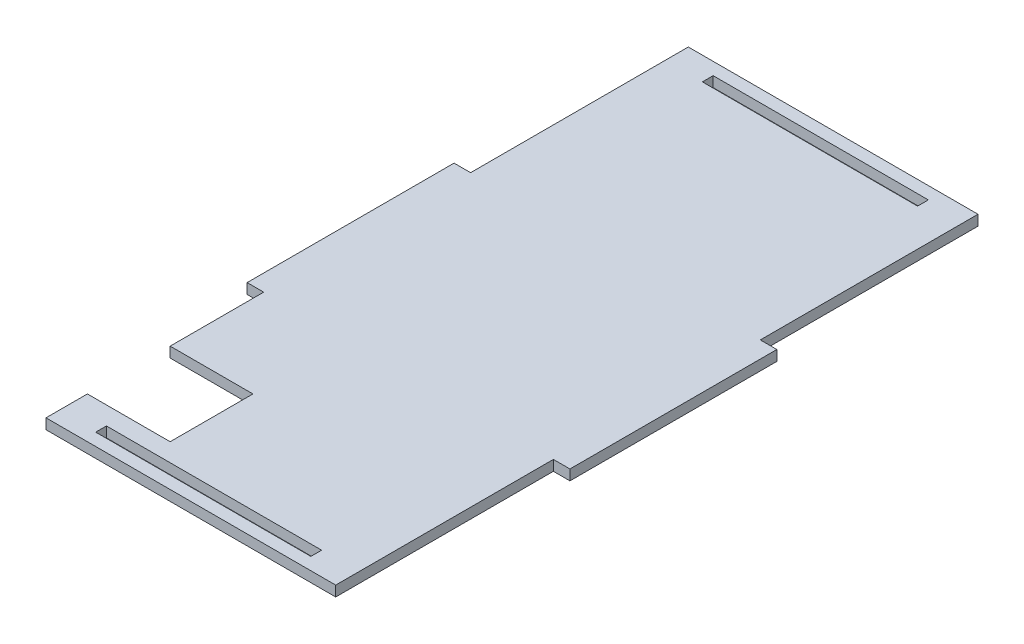
ISO-10303-21;
HEADER;
FILE_DESCRIPTION(('STEP AP214'),'2;1');
FILE_NAME('part.step','',(''),(''),'','','');
FILE_SCHEMA(('AUTOMOTIVE_DESIGN { 1 0 10303 214 1 1 1 1 }'));
ENDSEC;
DATA;
#1=APPLICATION_CONTEXT('core data for automotive mechanical design processes');
#2=APPLICATION_PROTOCOL_DEFINITION('international standard','automotive_design',2000,#1);
#3=PRODUCT_CONTEXT('',#1,'mechanical');
#4=PRODUCT('Part','Part','',(#3));
#5=PRODUCT_RELATED_PRODUCT_CATEGORY('part','',(#4));
#6=PRODUCT_DEFINITION_FORMATION('','',#4);
#7=PRODUCT_DEFINITION_CONTEXT('part definition',#1,'design');
#8=PRODUCT_DEFINITION('design','',#6,#7);
#9=PRODUCT_DEFINITION_SHAPE('','',#8);
#10=(LENGTH_UNIT() NAMED_UNIT(*) SI_UNIT(.MILLI.,.METRE.));
#11=(NAMED_UNIT(*) PLANE_ANGLE_UNIT() SI_UNIT($,.RADIAN.));
#12=(NAMED_UNIT(*) SI_UNIT($,.STERADIAN.) SOLID_ANGLE_UNIT());
#13=UNCERTAINTY_MEASURE_WITH_UNIT(LENGTH_MEASURE(1.E-05),#10,'distance_accuracy_value','');
#14=(GEOMETRIC_REPRESENTATION_CONTEXT(3) GLOBAL_UNCERTAINTY_ASSIGNED_CONTEXT((#13)) GLOBAL_UNIT_ASSIGNED_CONTEXT((#10,
#11,#12)) REPRESENTATION_CONTEXT('',''));
#15=CARTESIAN_POINT('',(0.,0.,0.));
#16=DIRECTION('',(0.,0.,1.));
#17=DIRECTION('',(1.,0.,0.));
#18=AXIS2_PLACEMENT_3D('',#15,#16,#17);
#19=CARTESIAN_POINT('',(0.,2.5,0.));
#20=DIRECTION('',(0.,1.,0.));
#21=DIRECTION('',(0.,0.,1.));
#22=AXIS2_PLACEMENT_3D('',#19,#20,#21);
#23=PLANE('',#22);
#24=DIRECTION('',(0.,0.,1.));
#25=VECTOR('',#24,1.);
#26=CARTESIAN_POINT('',(-35.0000000000006,2.5,47.6));
#27=LINE('',#26,#25);
#28=CARTESIAN_POINT('',(-35.,2.5,25.));
#29=VERTEX_POINT('',#28);
#30=CARTESIAN_POINT('',(-35.0000000000006,2.5,47.6));
#31=VERTEX_POINT('',#30);
#32=EDGE_CURVE('E292',#29,#31,#27,.T.);
#33=ORIENTED_EDGE('',*,*,#32,.T.);
#34=DIRECTION('',(1.,0.,0.));
#35=VECTOR('',#34,1.);
#36=CARTESIAN_POINT('',(-35.0000000000006,2.5,47.6));
#37=LINE('',#36,#35);
#38=CARTESIAN_POINT('',(-15.0000000000006,2.5,47.6));
#39=VERTEX_POINT('',#38);
#40=EDGE_CURVE('E296',#31,#39,#37,.T.);
#41=ORIENTED_EDGE('',*,*,#40,.T.);
#42=DIRECTION('',(0.,0.,1.));
#43=VECTOR('',#42,1.);
#44=CARTESIAN_POINT('',(-15.0000000000006,2.5,47.6));
#45=LINE('',#44,#43);
#46=CARTESIAN_POINT('',(-15.0000000000006,2.5,67.6));
#47=VERTEX_POINT('',#46);
#48=EDGE_CURVE('E300',#39,#47,#45,.T.);
#49=ORIENTED_EDGE('',*,*,#48,.T.);
#50=DIRECTION('',(-1.,0.,0.));
#51=VECTOR('',#50,1.);
#52=CARTESIAN_POINT('',(-15.0000000000006,2.5,67.6));
#53=LINE('',#52,#51);
#54=CARTESIAN_POINT('',(-35.0000000000006,2.5,67.6));
#55=VERTEX_POINT('',#54);
#56=EDGE_CURVE('E303',#47,#55,#53,.T.);
#57=ORIENTED_EDGE('',*,*,#56,.T.);
#58=DIRECTION('',(0.,0.,1.));
#59=VECTOR('',#58,1.);
#60=CARTESIAN_POINT('',(-35.,2.5,77.6));
#61=LINE('',#60,#59);
#62=CARTESIAN_POINT('',(-35.,2.5,77.6));
#63=VERTEX_POINT('',#62);
#64=EDGE_CURVE('E306',#55,#63,#61,.T.);
#65=ORIENTED_EDGE('',*,*,#64,.T.);
#66=DIRECTION('',(1.,0.,0.));
#67=VECTOR('',#66,1.);
#68=CARTESIAN_POINT('',(35.,2.5,77.6));
#69=LINE('',#68,#67);
#70=CARTESIAN_POINT('',(35.,2.5,77.6));
#71=VERTEX_POINT('',#70);
#72=EDGE_CURVE('E309',#63,#71,#69,.T.);
#73=ORIENTED_EDGE('',*,*,#72,.T.);
#74=DIRECTION('',(0.,0.,-1.));
#75=VECTOR('',#74,1.);
#76=CARTESIAN_POINT('',(34.9999999999998,2.5,25.0000000000003));
#77=LINE('',#76,#75);
#78=CARTESIAN_POINT('',(34.9999999999998,2.5,25.0000000000003));
#79=VERTEX_POINT('',#78);
#80=EDGE_CURVE('E312',#71,#79,#77,.T.);
#81=ORIENTED_EDGE('',*,*,#80,.T.);
#82=DIRECTION('',(1.,0.,-1.41379963292089E-13));
#83=VECTOR('',#82,1.);
#84=CARTESIAN_POINT('',(34.9999999999998,2.5,25.0000000000003));
#85=LINE('',#84,#83);
#86=CARTESIAN_POINT('',(39.0000000000004,2.5,24.9999999999997));
#87=VERTEX_POINT('',#86);
#88=EDGE_CURVE('E315',#79,#87,#85,.T.);
#89=ORIENTED_EDGE('',*,*,#88,.T.);
#90=DIRECTION('',(0.,0.,-1.));
#91=VECTOR('',#90,1.);
#92=CARTESIAN_POINT('',(39.,2.5,-25.0000000000003));
#93=LINE('',#92,#91);
#94=CARTESIAN_POINT('',(39.,2.5,-25.0000000000003));
#95=VERTEX_POINT('',#94);
#96=EDGE_CURVE('E318',#87,#95,#93,.T.);
#97=ORIENTED_EDGE('',*,*,#96,.T.);
#98=DIRECTION('',(-1.,0.,0.));
#99=VECTOR('',#98,1.);
#100=CARTESIAN_POINT('',(34.9999999999998,2.5,-25.0000000000003));
#101=LINE('',#100,#99);
#102=CARTESIAN_POINT('',(34.9999999999998,2.5,-25.0000000000003));
#103=VERTEX_POINT('',#102);
#104=EDGE_CURVE('E321',#95,#103,#101,.T.);
#105=ORIENTED_EDGE('',*,*,#104,.T.);
#106=DIRECTION('',(0.,0.,-1.));
#107=VECTOR('',#106,1.);
#108=CARTESIAN_POINT('',(34.9999999999998,2.5,-25.0000000000003));
#109=LINE('',#108,#107);
#110=CARTESIAN_POINT('',(35.,2.5,-77.6));
#111=VERTEX_POINT('',#110);
#112=EDGE_CURVE('E324',#103,#111,#109,.T.);
#113=ORIENTED_EDGE('',*,*,#112,.T.);
#114=DIRECTION('',(-1.,0.,0.));
#115=VECTOR('',#114,1.);
#116=CARTESIAN_POINT('',(35.,2.5,-77.6));
#117=LINE('',#116,#115);
#118=CARTESIAN_POINT('',(-35.,2.5,-77.6));
#119=VERTEX_POINT('',#118);
#120=EDGE_CURVE('E327',#111,#119,#117,.T.);
#121=ORIENTED_EDGE('',*,*,#120,.T.);
#122=DIRECTION('',(0.,0.,1.));
#123=VECTOR('',#122,1.);
#124=CARTESIAN_POINT('',(-35.,2.5,-77.6));
#125=LINE('',#124,#123);
#126=CARTESIAN_POINT('',(-35.,2.5,-25.));
#127=VERTEX_POINT('',#126);
#128=EDGE_CURVE('E330',#119,#127,#125,.T.);
#129=ORIENTED_EDGE('',*,*,#128,.T.);
#130=DIRECTION('',(-1.,0.,0.));
#131=VECTOR('',#130,1.);
#132=CARTESIAN_POINT('',(-35.,2.5,-25.));
#133=LINE('',#132,#131);
#134=CARTESIAN_POINT('',(-39.0000000000002,2.5,-25.));
#135=VERTEX_POINT('',#134);
#136=EDGE_CURVE('E333',#127,#135,#133,.T.);
#137=ORIENTED_EDGE('',*,*,#136,.T.);
#138=DIRECTION('',(0.,0.,1.));
#139=VECTOR('',#138,1.);
#140=CARTESIAN_POINT('',(-39.0000000000002,2.5,-25.));
#141=LINE('',#140,#139);
#142=CARTESIAN_POINT('',(-39.0000000000002,2.5,25.));
#143=VERTEX_POINT('',#142);
#144=EDGE_CURVE('E336',#135,#143,#141,.T.);
#145=ORIENTED_EDGE('',*,*,#144,.T.);
#146=DIRECTION('',(1.,0.,0.));
#147=VECTOR('',#146,1.);
#148=CARTESIAN_POINT('',(-35.,2.5,25.));
#149=LINE('',#148,#147);
#150=EDGE_CURVE('E339',#143,#29,#149,.T.);
#151=ORIENTED_EDGE('',*,*,#150,.T.);
#152=EDGE_LOOP('',(#33,#41,#49,#57,#65,#73,#81,#89,#97,#105,#113,#121,#129,#137,#145,#151));
#153=FACE_BOUND('',#152,.T.);
#154=DIRECTION('',(1.,0.,0.));
#155=VECTOR('',#154,1.);
#156=CARTESIAN_POINT('',(-26.,2.5,74.6));
#157=LINE('',#156,#155);
#158=CARTESIAN_POINT('',(-26.,2.5,74.6));
#159=VERTEX_POINT('',#158);
#160=CARTESIAN_POINT('',(26.,2.5,74.6));
#161=VERTEX_POINT('',#160);
#162=EDGE_CURVE('E252',#159,#161,#157,.T.);
#163=ORIENTED_EDGE('',*,*,#162,.F.);
#164=DIRECTION('',(0.,0.,1.));
#165=VECTOR('',#164,1.);
#166=CARTESIAN_POINT('',(-26.,2.5,74.6));
#167=LINE('',#166,#165);
#168=CARTESIAN_POINT('',(-26.,2.5,72.));
#169=VERTEX_POINT('',#168);
#170=EDGE_CURVE('E249',#169,#159,#167,.T.);
#171=ORIENTED_EDGE('',*,*,#170,.F.);
#172=DIRECTION('',(-1.,0.,0.));
#173=VECTOR('',#172,1.);
#174=CARTESIAN_POINT('',(-26.,2.5,72.));
#175=LINE('',#174,#173);
#176=CARTESIAN_POINT('',(26.,2.5,72.));
#177=VERTEX_POINT('',#176);
#178=EDGE_CURVE('E260',#177,#169,#175,.T.);
#179=ORIENTED_EDGE('',*,*,#178,.F.);
#180=DIRECTION('',(0.,0.,-1.));
#181=VECTOR('',#180,1.);
#182=CARTESIAN_POINT('',(26.,2.5,74.6));
#183=LINE('',#182,#181);
#184=EDGE_CURVE('E256',#161,#177,#183,.T.);
#185=ORIENTED_EDGE('',*,*,#184,.F.);
#186=EDGE_LOOP('',(#163,#171,#179,#185));
#187=FACE_BOUND('',#186,.T.);
#188=DIRECTION('',(0.,0.,1.));
#189=VECTOR('',#188,1.);
#190=CARTESIAN_POINT('',(-26.,2.5,-74.6));
#191=LINE('',#190,#189);
#192=CARTESIAN_POINT('',(-26.,2.5,-74.6));
#193=VERTEX_POINT('',#192);
#194=CARTESIAN_POINT('',(-26.,2.5,-72.));
#195=VERTEX_POINT('',#194);
#196=EDGE_CURVE('E210',#193,#195,#191,.T.);
#197=ORIENTED_EDGE('',*,*,#196,.F.);
#198=DIRECTION('',(-1.,0.,0.));
#199=VECTOR('',#198,1.);
#200=CARTESIAN_POINT('',(-26.,2.5,-74.6));
#201=LINE('',#200,#199);
#202=CARTESIAN_POINT('',(26.,2.5,-74.6));
#203=VERTEX_POINT('',#202);
#204=EDGE_CURVE('E201',#203,#193,#201,.T.);
#205=ORIENTED_EDGE('',*,*,#204,.F.);
#206=DIRECTION('',(0.,0.,-1.));
#207=VECTOR('',#206,1.);
#208=CARTESIAN_POINT('',(26.,2.5,-74.6));
#209=LINE('',#208,#207);
#210=CARTESIAN_POINT('',(26.,2.5,-72.));
#211=VERTEX_POINT('',#210);
#212=EDGE_CURVE('E227',#211,#203,#209,.T.);
#213=ORIENTED_EDGE('',*,*,#212,.F.);
#214=DIRECTION('',(1.,0.,0.));
#215=VECTOR('',#214,1.);
#216=CARTESIAN_POINT('',(-26.,2.5,-72.));
#217=LINE('',#216,#215);
#218=EDGE_CURVE('E223',#195,#211,#217,.T.);
#219=ORIENTED_EDGE('',*,*,#218,.F.);
#220=EDGE_LOOP('',(#197,#205,#213,#219));
#221=FACE_BOUND('',#220,.T.);
#222=ADVANCED_FACE('F39',(#153,#187,#221),#23,.T.);
#223=CARTESIAN_POINT('',(0.,0.,0.));
#224=DIRECTION('',(0.,1.,0.));
#225=DIRECTION('',(0.,0.,1.));
#226=AXIS2_PLACEMENT_3D('',#223,#224,#225);
#227=PLANE('',#226);
#228=DIRECTION('',(0.,0.,1.));
#229=VECTOR('',#228,1.);
#230=CARTESIAN_POINT('',(-26.,0.,74.6));
#231=LINE('',#230,#229);
#232=CARTESIAN_POINT('',(-26.,0.,72.));
#233=VERTEX_POINT('',#232);
#234=CARTESIAN_POINT('',(-26.,0.,74.6));
#235=VERTEX_POINT('',#234);
#236=EDGE_CURVE('E219',#233,#235,#231,.T.);
#237=ORIENTED_EDGE('',*,*,#236,.T.);
#238=DIRECTION('',(1.,0.,0.));
#239=VECTOR('',#238,1.);
#240=CARTESIAN_POINT('',(-26.,0.,74.6));
#241=LINE('',#240,#239);
#242=CARTESIAN_POINT('',(26.,0.,74.6));
#243=VERTEX_POINT('',#242);
#244=EDGE_CURVE('E267',#235,#243,#241,.T.);
#245=ORIENTED_EDGE('',*,*,#244,.T.);
#246=DIRECTION('',(0.,0.,-1.));
#247=VECTOR('',#246,1.);
#248=CARTESIAN_POINT('',(26.,0.,74.6));
#249=LINE('',#248,#247);
#250=CARTESIAN_POINT('',(26.,0.,72.));
#251=VERTEX_POINT('',#250);
#252=EDGE_CURVE('E271',#243,#251,#249,.T.);
#253=ORIENTED_EDGE('',*,*,#252,.T.);
#254=DIRECTION('',(-1.,0.,0.));
#255=VECTOR('',#254,1.);
#256=CARTESIAN_POINT('',(-26.,0.,72.));
#257=LINE('',#256,#255);
#258=EDGE_CURVE('E253',#251,#233,#257,.T.);
#259=ORIENTED_EDGE('',*,*,#258,.T.);
#260=EDGE_LOOP('',(#237,#245,#253,#259));
#261=FACE_BOUND('',#260,.T.);
#262=DIRECTION('',(0.,0.,1.));
#263=VECTOR('',#262,1.);
#264=CARTESIAN_POINT('',(-35.0000000000006,0.,47.6));
#265=LINE('',#264,#263);
#266=CARTESIAN_POINT('',(-35.,0.,25.));
#267=VERTEX_POINT('',#266);
#268=CARTESIAN_POINT('',(-35.0000000000006,0.,47.6));
#269=VERTEX_POINT('',#268);
#270=EDGE_CURVE('E291',#267,#269,#265,.T.);
#271=ORIENTED_EDGE('',*,*,#270,.F.);
#272=DIRECTION('',(1.,0.,0.));
#273=VECTOR('',#272,1.);
#274=CARTESIAN_POINT('',(-35.,0.,25.));
#275=LINE('',#274,#273);
#276=CARTESIAN_POINT('',(-39.0000000000002,0.,25.));
#277=VERTEX_POINT('',#276);
#278=EDGE_CURVE('E297',#277,#267,#275,.T.);
#279=ORIENTED_EDGE('',*,*,#278,.F.);
#280=DIRECTION('',(0.,0.,1.));
#281=VECTOR('',#280,1.);
#282=CARTESIAN_POINT('',(-39.0000000000002,0.,-25.));
#283=LINE('',#282,#281);
#284=CARTESIAN_POINT('',(-39.0000000000002,0.,-25.));
#285=VERTEX_POINT('',#284);
#286=EDGE_CURVE('E385',#285,#277,#283,.T.);
#287=ORIENTED_EDGE('',*,*,#286,.F.);
#288=DIRECTION('',(-1.,0.,0.));
#289=VECTOR('',#288,1.);
#290=CARTESIAN_POINT('',(-35.,0.,-25.));
#291=LINE('',#290,#289);
#292=CARTESIAN_POINT('',(-35.,0.,-25.));
#293=VERTEX_POINT('',#292);
#294=EDGE_CURVE('E382',#293,#285,#291,.T.);
#295=ORIENTED_EDGE('',*,*,#294,.F.);
#296=DIRECTION('',(0.,0.,1.));
#297=VECTOR('',#296,1.);
#298=CARTESIAN_POINT('',(-35.,0.,-77.6));
#299=LINE('',#298,#297);
#300=CARTESIAN_POINT('',(-35.,0.,-77.6));
#301=VERTEX_POINT('',#300);
#302=EDGE_CURVE('E379',#301,#293,#299,.T.);
#303=ORIENTED_EDGE('',*,*,#302,.F.);
#304=DIRECTION('',(-1.,0.,0.));
#305=VECTOR('',#304,1.);
#306=CARTESIAN_POINT('',(35.,0.,-77.6));
#307=LINE('',#306,#305);
#308=CARTESIAN_POINT('',(35.,0.,-77.6));
#309=VERTEX_POINT('',#308);
#310=EDGE_CURVE('E376',#309,#301,#307,.T.);
#311=ORIENTED_EDGE('',*,*,#310,.F.);
#312=DIRECTION('',(0.,0.,-1.));
#313=VECTOR('',#312,1.);
#314=CARTESIAN_POINT('',(34.9999999999998,0.,-25.0000000000003));
#315=LINE('',#314,#313);
#316=CARTESIAN_POINT('',(34.9999999999998,0.,-25.0000000000003));
#317=VERTEX_POINT('',#316);
#318=EDGE_CURVE('E373',#317,#309,#315,.T.);
#319=ORIENTED_EDGE('',*,*,#318,.F.);
#320=DIRECTION('',(-1.,0.,0.));
#321=VECTOR('',#320,1.);
#322=CARTESIAN_POINT('',(34.9999999999998,0.,-25.0000000000003));
#323=LINE('',#322,#321);
#324=CARTESIAN_POINT('',(39.,0.,-25.0000000000003));
#325=VERTEX_POINT('',#324);
#326=EDGE_CURVE('E370',#325,#317,#323,.T.);
#327=ORIENTED_EDGE('',*,*,#326,.F.);
#328=DIRECTION('',(0.,0.,-1.));
#329=VECTOR('',#328,1.);
#330=CARTESIAN_POINT('',(39.,0.,-25.0000000000003));
#331=LINE('',#330,#329);
#332=CARTESIAN_POINT('',(39.0000000000004,0.,24.9999999999997));
#333=VERTEX_POINT('',#332);
#334=EDGE_CURVE('E367',#333,#325,#331,.T.);
#335=ORIENTED_EDGE('',*,*,#334,.F.);
#336=DIRECTION('',(1.,0.,-1.41379963292089E-13));
#337=VECTOR('',#336,1.);
#338=CARTESIAN_POINT('',(34.9999999999998,0.,25.0000000000003));
#339=LINE('',#338,#337);
#340=CARTESIAN_POINT('',(34.9999999999998,0.,25.0000000000003));
#341=VERTEX_POINT('',#340);
#342=EDGE_CURVE('E364',#341,#333,#339,.T.);
#343=ORIENTED_EDGE('',*,*,#342,.F.);
#344=DIRECTION('',(0.,0.,-1.));
#345=VECTOR('',#344,1.);
#346=CARTESIAN_POINT('',(34.9999999999998,0.,25.0000000000003));
#347=LINE('',#346,#345);
#348=CARTESIAN_POINT('',(35.,0.,77.6));
#349=VERTEX_POINT('',#348);
#350=EDGE_CURVE('E361',#349,#341,#347,.T.);
#351=ORIENTED_EDGE('',*,*,#350,.F.);
#352=DIRECTION('',(1.,0.,0.));
#353=VECTOR('',#352,1.);
#354=CARTESIAN_POINT('',(35.,0.,77.6));
#355=LINE('',#354,#353);
#356=CARTESIAN_POINT('',(-35.,0.,77.6));
#357=VERTEX_POINT('',#356);
#358=EDGE_CURVE('E358',#357,#349,#355,.T.);
#359=ORIENTED_EDGE('',*,*,#358,.F.);
#360=DIRECTION('',(0.,0.,1.));
#361=VECTOR('',#360,1.);
#362=CARTESIAN_POINT('',(-35.,0.,77.6));
#363=LINE('',#362,#361);
#364=CARTESIAN_POINT('',(-35.0000000000006,0.,67.6));
#365=VERTEX_POINT('',#364);
#366=EDGE_CURVE('E355',#365,#357,#363,.T.);
#367=ORIENTED_EDGE('',*,*,#366,.F.);
#368=DIRECTION('',(-1.,0.,0.));
#369=VECTOR('',#368,1.);
#370=CARTESIAN_POINT('',(-15.0000000000006,0.,67.6));
#371=LINE('',#370,#369);
#372=CARTESIAN_POINT('',(-15.0000000000006,0.,67.6));
#373=VERTEX_POINT('',#372);
#374=EDGE_CURVE('E352',#373,#365,#371,.T.);
#375=ORIENTED_EDGE('',*,*,#374,.F.);
#376=DIRECTION('',(0.,0.,1.));
#377=VECTOR('',#376,1.);
#378=CARTESIAN_POINT('',(-15.0000000000006,0.,47.6));
#379=LINE('',#378,#377);
#380=CARTESIAN_POINT('',(-15.0000000000006,0.,47.6));
#381=VERTEX_POINT('',#380);
#382=EDGE_CURVE('E349',#381,#373,#379,.T.);
#383=ORIENTED_EDGE('',*,*,#382,.F.);
#384=DIRECTION('',(1.,0.,0.));
#385=VECTOR('',#384,1.);
#386=CARTESIAN_POINT('',(-35.0000000000006,0.,47.6));
#387=LINE('',#386,#385);
#388=EDGE_CURVE('E346',#269,#381,#387,.T.);
#389=ORIENTED_EDGE('',*,*,#388,.F.);
#390=EDGE_LOOP('',(#271,#279,#287,#295,#303,#311,#319,#327,#335,#343,#351,#359,#367,#375,#383,#389));
#391=FACE_BOUND('',#390,.T.);
#392=DIRECTION('',(-1.,0.,0.));
#393=VECTOR('',#392,1.);
#394=CARTESIAN_POINT('',(-26.,0.,-74.6));
#395=LINE('',#394,#393);
#396=CARTESIAN_POINT('',(26.,0.,-74.6));
#397=VERTEX_POINT('',#396);
#398=CARTESIAN_POINT('',(-26.,0.,-74.6));
#399=VERTEX_POINT('',#398);
#400=EDGE_CURVE('E63',#397,#399,#395,.T.);
#401=ORIENTED_EDGE('',*,*,#400,.T.);
#402=DIRECTION('',(0.,0.,1.));
#403=VECTOR('',#402,1.);
#404=CARTESIAN_POINT('',(-26.,0.,-74.6));
#405=LINE('',#404,#403);
#406=CARTESIAN_POINT('',(-26.,0.,-72.));
#407=VERTEX_POINT('',#406);
#408=EDGE_CURVE('E217',#399,#407,#405,.T.);
#409=ORIENTED_EDGE('',*,*,#408,.T.);
#410=DIRECTION('',(1.,0.,0.));
#411=VECTOR('',#410,1.);
#412=CARTESIAN_POINT('',(-26.,0.,-72.));
#413=LINE('',#412,#411);
#414=CARTESIAN_POINT('',(26.,0.,-72.));
#415=VERTEX_POINT('',#414);
#416=EDGE_CURVE('E236',#407,#415,#413,.T.);
#417=ORIENTED_EDGE('',*,*,#416,.T.);
#418=DIRECTION('',(0.,0.,-1.));
#419=VECTOR('',#418,1.);
#420=CARTESIAN_POINT('',(26.,0.,-74.6));
#421=LINE('',#420,#419);
#422=EDGE_CURVE('E211',#415,#397,#421,.T.);
#423=ORIENTED_EDGE('',*,*,#422,.T.);
#424=EDGE_LOOP('',(#401,#409,#417,#423));
#425=FACE_BOUND('',#424,.T.);
#426=ADVANCED_FACE('F456',(#261,#391,#425),#227,.F.);
#427=CARTESIAN_POINT('',(-35.0000000000006,2.5,47.6));
#428=DIRECTION('',(1.,0.,0.));
#429=DIRECTION('',(0.,0.,-1.));
#430=AXIS2_PLACEMENT_3D('',#427,#428,#429);
#431=PLANE('',#430);
#432=ORIENTED_EDGE('',*,*,#270,.T.);
#433=DIRECTION('',(0.,-1.,0.));
#434=VECTOR('',#433,1.);
#435=CARTESIAN_POINT('',(-35.0000000000006,2.5,47.6));
#436=LINE('',#435,#434);
#437=EDGE_CURVE('E11',#31,#269,#436,.T.);
#438=ORIENTED_EDGE('',*,*,#437,.F.);
#439=ORIENTED_EDGE('',*,*,#32,.F.);
#440=DIRECTION('',(0.,-1.,0.));
#441=VECTOR('',#440,1.);
#442=CARTESIAN_POINT('',(-35.,2.5,25.));
#443=LINE('',#442,#441);
#444=EDGE_CURVE('E342',#29,#267,#443,.T.);
#445=ORIENTED_EDGE('',*,*,#444,.T.);
#446=EDGE_LOOP('',(#432,#438,#439,#445));
#447=FACE_BOUND('',#446,.T.);
#448=ADVANCED_FACE('F41',(#447),#431,.F.);
#449=CARTESIAN_POINT('',(-35.0000000000006,2.5,47.6));
#450=DIRECTION('',(0.,0.,-1.));
#451=DIRECTION('',(-1.,0.,0.));
#452=AXIS2_PLACEMENT_3D('',#449,#450,#451);
#453=PLANE('',#452);
#454=ORIENTED_EDGE('',*,*,#388,.T.);
#455=DIRECTION('',(0.,-1.,0.));
#456=VECTOR('',#455,1.);
#457=CARTESIAN_POINT('',(-15.0000000000006,2.5,47.6));
#458=LINE('',#457,#456);
#459=EDGE_CURVE('E48',#39,#381,#458,.T.);
#460=ORIENTED_EDGE('',*,*,#459,.F.);
#461=ORIENTED_EDGE('',*,*,#40,.F.);
#462=ORIENTED_EDGE('',*,*,#437,.T.);
#463=EDGE_LOOP('',(#454,#460,#461,#462));
#464=FACE_BOUND('',#463,.T.);
#465=ADVANCED_FACE('F474',(#464),#453,.F.);
#466=CARTESIAN_POINT('',(-15.0000000000006,2.5,47.6));
#467=DIRECTION('',(1.,0.,0.));
#468=DIRECTION('',(0.,0.,-1.));
#469=AXIS2_PLACEMENT_3D('',#466,#467,#468);
#470=PLANE('',#469);
#471=ORIENTED_EDGE('',*,*,#382,.T.);
#472=DIRECTION('',(0.,-1.,0.));
#473=VECTOR('',#472,1.);
#474=CARTESIAN_POINT('',(-15.0000000000006,2.5,67.6));
#475=LINE('',#474,#473);
#476=EDGE_CURVE('E441',#47,#373,#475,.T.);
#477=ORIENTED_EDGE('',*,*,#476,.F.);
#478=ORIENTED_EDGE('',*,*,#48,.F.);
#479=ORIENTED_EDGE('',*,*,#459,.T.);
#480=EDGE_LOOP('',(#471,#477,#478,#479));
#481=FACE_BOUND('',#480,.T.);
#482=ADVANCED_FACE('F450',(#481),#470,.F.);
#483=CARTESIAN_POINT('',(-15.0000000000006,2.5,67.6));
#484=DIRECTION('',(0.,0.,1.));
#485=DIRECTION('',(1.,0.,0.));
#486=AXIS2_PLACEMENT_3D('',#483,#484,#485);
#487=PLANE('',#486);
#488=ORIENTED_EDGE('',*,*,#374,.T.);
#489=DIRECTION('',(0.,-1.,0.));
#490=VECTOR('',#489,1.);
#491=CARTESIAN_POINT('',(-35.0000000000006,2.5,67.6));
#492=LINE('',#491,#490);
#493=EDGE_CURVE('E437',#55,#365,#492,.T.);
#494=ORIENTED_EDGE('',*,*,#493,.F.);
#495=ORIENTED_EDGE('',*,*,#56,.F.);
#496=ORIENTED_EDGE('',*,*,#476,.T.);
#497=EDGE_LOOP('',(#488,#494,#495,#496));
#498=FACE_BOUND('',#497,.T.);
#499=ADVANCED_FACE('F462',(#498),#487,.F.);
#500=CARTESIAN_POINT('',(-35.,2.5,77.6));
#501=DIRECTION('',(1.,0.,0.));
#502=DIRECTION('',(0.,0.,-1.));
#503=AXIS2_PLACEMENT_3D('',#500,#501,#502);
#504=PLANE('',#503);
#505=ORIENTED_EDGE('',*,*,#366,.T.);
#506=DIRECTION('',(0.,-1.,0.));
#507=VECTOR('',#506,1.);
#508=CARTESIAN_POINT('',(-35.,2.5,77.6));
#509=LINE('',#508,#507);
#510=EDGE_CURVE('E433',#63,#357,#509,.T.);
#511=ORIENTED_EDGE('',*,*,#510,.F.);
#512=ORIENTED_EDGE('',*,*,#64,.F.);
#513=ORIENTED_EDGE('',*,*,#493,.T.);
#514=EDGE_LOOP('',(#505,#511,#512,#513));
#515=FACE_BOUND('',#514,.T.);
#516=ADVANCED_FACE('F466',(#515),#504,.F.);
#517=CARTESIAN_POINT('',(35.,2.5,77.6));
#518=DIRECTION('',(0.,0.,-1.));
#519=DIRECTION('',(-1.,0.,0.));
#520=AXIS2_PLACEMENT_3D('',#517,#518,#519);
#521=PLANE('',#520);
#522=ORIENTED_EDGE('',*,*,#358,.T.);
#523=DIRECTION('',(0.,-1.,0.));
#524=VECTOR('',#523,1.);
#525=CARTESIAN_POINT('',(35.,2.5,77.6));
#526=LINE('',#525,#524);
#527=EDGE_CURVE('E429',#71,#349,#526,.T.);
#528=ORIENTED_EDGE('',*,*,#527,.F.);
#529=ORIENTED_EDGE('',*,*,#72,.F.);
#530=ORIENTED_EDGE('',*,*,#510,.T.);
#531=EDGE_LOOP('',(#522,#528,#529,#530));
#532=FACE_BOUND('',#531,.T.);
#533=ADVANCED_FACE('F527',(#532),#521,.F.);
#534=CARTESIAN_POINT('',(34.9999999999998,2.5,25.0000000000003));
#535=DIRECTION('',(-1.,0.,0.));
#536=DIRECTION('',(0.,0.,1.));
#537=AXIS2_PLACEMENT_3D('',#534,#535,#536);
#538=PLANE('',#537);
#539=ORIENTED_EDGE('',*,*,#350,.T.);
#540=DIRECTION('',(0.,-1.,0.));
#541=VECTOR('',#540,1.);
#542=CARTESIAN_POINT('',(34.9999999999998,2.5,25.0000000000003));
#543=LINE('',#542,#541);
#544=EDGE_CURVE('E425',#79,#341,#543,.T.);
#545=ORIENTED_EDGE('',*,*,#544,.F.);
#546=ORIENTED_EDGE('',*,*,#80,.F.);
#547=ORIENTED_EDGE('',*,*,#527,.T.);
#548=EDGE_LOOP('',(#539,#545,#546,#547));
#549=FACE_BOUND('',#548,.T.);
#550=ADVANCED_FACE('F524',(#549),#538,.F.);
#551=CARTESIAN_POINT('',(34.9999999999998,2.5,25.0000000000003));
#552=DIRECTION('',(-1.41379963292089E-13,0.,-1.));
#553=DIRECTION('',(-1.,0.,1.41379963292089E-13));
#554=AXIS2_PLACEMENT_3D('',#551,#552,#553);
#555=PLANE('',#554);
#556=ORIENTED_EDGE('',*,*,#342,.T.);
#557=DIRECTION('',(0.,-1.,0.));
#558=VECTOR('',#557,1.);
#559=CARTESIAN_POINT('',(39.0000000000004,2.5,24.9999999999997));
#560=LINE('',#559,#558);
#561=EDGE_CURVE('E421',#87,#333,#560,.T.);
#562=ORIENTED_EDGE('',*,*,#561,.F.);
#563=ORIENTED_EDGE('',*,*,#88,.F.);
#564=ORIENTED_EDGE('',*,*,#544,.T.);
#565=EDGE_LOOP('',(#556,#562,#563,#564));
#566=FACE_BOUND('',#565,.T.);
#567=ADVANCED_FACE('F520',(#566),#555,.F.);
#568=CARTESIAN_POINT('',(39.,2.5,-25.0000000000003));
#569=DIRECTION('',(-1.,0.,0.));
#570=DIRECTION('',(0.,0.,1.));
#571=AXIS2_PLACEMENT_3D('',#568,#569,#570);
#572=PLANE('',#571);
#573=ORIENTED_EDGE('',*,*,#334,.T.);
#574=DIRECTION('',(0.,-1.,0.));
#575=VECTOR('',#574,1.);
#576=CARTESIAN_POINT('',(39.,2.5,-25.0000000000003));
#577=LINE('',#576,#575);
#578=EDGE_CURVE('E417',#95,#325,#577,.T.);
#579=ORIENTED_EDGE('',*,*,#578,.F.);
#580=ORIENTED_EDGE('',*,*,#96,.F.);
#581=ORIENTED_EDGE('',*,*,#561,.T.);
#582=EDGE_LOOP('',(#573,#579,#580,#581));
#583=FACE_BOUND('',#582,.T.);
#584=ADVANCED_FACE('F516',(#583),#572,.F.);
#585=CARTESIAN_POINT('',(34.9999999999998,2.5,-25.0000000000003));
#586=DIRECTION('',(0.,0.,1.));
#587=DIRECTION('',(1.,0.,0.));
#588=AXIS2_PLACEMENT_3D('',#585,#586,#587);
#589=PLANE('',#588);
#590=ORIENTED_EDGE('',*,*,#326,.T.);
#591=DIRECTION('',(0.,-1.,0.));
#592=VECTOR('',#591,1.);
#593=CARTESIAN_POINT('',(34.9999999999998,2.5,-25.0000000000003));
#594=LINE('',#593,#592);
#595=EDGE_CURVE('E413',#103,#317,#594,.T.);
#596=ORIENTED_EDGE('',*,*,#595,.F.);
#597=ORIENTED_EDGE('',*,*,#104,.F.);
#598=ORIENTED_EDGE('',*,*,#578,.T.);
#599=EDGE_LOOP('',(#590,#596,#597,#598));
#600=FACE_BOUND('',#599,.T.);
#601=ADVANCED_FACE('F511',(#600),#589,.F.);
#602=CARTESIAN_POINT('',(34.9999999999998,2.5,-25.0000000000003));
#603=DIRECTION('',(-1.,0.,0.));
#604=DIRECTION('',(0.,0.,1.));
#605=AXIS2_PLACEMENT_3D('',#602,#603,#604);
#606=PLANE('',#605);
#607=ORIENTED_EDGE('',*,*,#318,.T.);
#608=DIRECTION('',(0.,-1.,0.));
#609=VECTOR('',#608,1.);
#610=CARTESIAN_POINT('',(35.,2.5,-77.6));
#611=LINE('',#610,#609);
#612=EDGE_CURVE('E409',#111,#309,#611,.T.);
#613=ORIENTED_EDGE('',*,*,#612,.F.);
#614=ORIENTED_EDGE('',*,*,#112,.F.);
#615=ORIENTED_EDGE('',*,*,#595,.T.);
#616=EDGE_LOOP('',(#607,#613,#614,#615));
#617=FACE_BOUND('',#616,.T.);
#618=ADVANCED_FACE('F505',(#617),#606,.F.);
#619=CARTESIAN_POINT('',(35.,2.5,-77.6));
#620=DIRECTION('',(0.,0.,1.));
#621=DIRECTION('',(1.,0.,0.));
#622=AXIS2_PLACEMENT_3D('',#619,#620,#621);
#623=PLANE('',#622);
#624=ORIENTED_EDGE('',*,*,#310,.T.);
#625=DIRECTION('',(0.,-1.,0.));
#626=VECTOR('',#625,1.);
#627=CARTESIAN_POINT('',(-35.,2.5,-77.6));
#628=LINE('',#627,#626);
#629=EDGE_CURVE('E405',#119,#301,#628,.T.);
#630=ORIENTED_EDGE('',*,*,#629,.F.);
#631=ORIENTED_EDGE('',*,*,#120,.F.);
#632=ORIENTED_EDGE('',*,*,#612,.T.);
#633=EDGE_LOOP('',(#624,#630,#631,#632));
#634=FACE_BOUND('',#633,.T.);
#635=ADVANCED_FACE('F501',(#634),#623,.F.);
#636=CARTESIAN_POINT('',(-35.,2.5,-77.6));
#637=DIRECTION('',(1.,0.,0.));
#638=DIRECTION('',(0.,0.,-1.));
#639=AXIS2_PLACEMENT_3D('',#636,#637,#638);
#640=PLANE('',#639);
#641=ORIENTED_EDGE('',*,*,#302,.T.);
#642=DIRECTION('',(0.,-1.,0.));
#643=VECTOR('',#642,1.);
#644=CARTESIAN_POINT('',(-35.,2.5,-25.));
#645=LINE('',#644,#643);
#646=EDGE_CURVE('E401',#127,#293,#645,.T.);
#647=ORIENTED_EDGE('',*,*,#646,.F.);
#648=ORIENTED_EDGE('',*,*,#128,.F.);
#649=ORIENTED_EDGE('',*,*,#629,.T.);
#650=EDGE_LOOP('',(#641,#647,#648,#649));
#651=FACE_BOUND('',#650,.T.);
#652=ADVANCED_FACE('F496',(#651),#640,.F.);
#653=CARTESIAN_POINT('',(-35.,2.5,-25.));
#654=DIRECTION('',(0.,0.,1.));
#655=DIRECTION('',(1.,0.,0.));
#656=AXIS2_PLACEMENT_3D('',#653,#654,#655);
#657=PLANE('',#656);
#658=ORIENTED_EDGE('',*,*,#294,.T.);
#659=DIRECTION('',(0.,-1.,0.));
#660=VECTOR('',#659,1.);
#661=CARTESIAN_POINT('',(-39.0000000000002,2.5,-25.));
#662=LINE('',#661,#660);
#663=EDGE_CURVE('E397',#135,#285,#662,.T.);
#664=ORIENTED_EDGE('',*,*,#663,.F.);
#665=ORIENTED_EDGE('',*,*,#136,.F.);
#666=ORIENTED_EDGE('',*,*,#646,.T.);
#667=EDGE_LOOP('',(#658,#664,#665,#666));
#668=FACE_BOUND('',#667,.T.);
#669=ADVANCED_FACE('F490',(#668),#657,.F.);
#670=CARTESIAN_POINT('',(-39.0000000000002,2.5,-25.));
#671=DIRECTION('',(1.,0.,0.));
#672=DIRECTION('',(0.,0.,-1.));
#673=AXIS2_PLACEMENT_3D('',#670,#671,#672);
#674=PLANE('',#673);
#675=ORIENTED_EDGE('',*,*,#286,.T.);
#676=DIRECTION('',(0.,-1.,0.));
#677=VECTOR('',#676,1.);
#678=CARTESIAN_POINT('',(-39.0000000000002,2.5,25.));
#679=LINE('',#678,#677);
#680=EDGE_CURVE('E393',#143,#277,#679,.T.);
#681=ORIENTED_EDGE('',*,*,#680,.F.);
#682=ORIENTED_EDGE('',*,*,#144,.F.);
#683=ORIENTED_EDGE('',*,*,#663,.T.);
#684=EDGE_LOOP('',(#675,#681,#682,#683));
#685=FACE_BOUND('',#684,.T.);
#686=ADVANCED_FACE('F486',(#685),#674,.F.);
#687=CARTESIAN_POINT('',(-35.,2.5,25.));
#688=DIRECTION('',(0.,0.,-1.));
#689=DIRECTION('',(-1.,0.,0.));
#690=AXIS2_PLACEMENT_3D('',#687,#688,#689);
#691=PLANE('',#690);
#692=ORIENTED_EDGE('',*,*,#278,.T.);
#693=ORIENTED_EDGE('',*,*,#444,.F.);
#694=ORIENTED_EDGE('',*,*,#150,.F.);
#695=ORIENTED_EDGE('',*,*,#680,.T.);
#696=EDGE_LOOP('',(#692,#693,#694,#695));
#697=FACE_BOUND('',#696,.T.);
#698=ADVANCED_FACE('F481',(#697),#691,.F.);
#699=CARTESIAN_POINT('',(-26.,2.5,74.6));
#700=DIRECTION('',(1.,0.,0.));
#701=DIRECTION('',(0.,0.,-1.));
#702=AXIS2_PLACEMENT_3D('',#699,#700,#701);
#703=PLANE('',#702);
#704=ORIENTED_EDGE('',*,*,#236,.F.);
#705=DIRECTION('',(0.,-1.,0.));
#706=VECTOR('',#705,1.);
#707=CARTESIAN_POINT('',(-26.,2.5,72.));
#708=LINE('',#707,#706);
#709=EDGE_CURVE('E263',#169,#233,#708,.T.);
#710=ORIENTED_EDGE('',*,*,#709,.F.);
#711=ORIENTED_EDGE('',*,*,#170,.T.);
#712=DIRECTION('',(0.,-1.,0.));
#713=VECTOR('',#712,1.);
#714=CARTESIAN_POINT('',(-26.,2.5,74.6));
#715=LINE('',#714,#713);
#716=EDGE_CURVE('E287',#159,#235,#715,.T.);
#717=ORIENTED_EDGE('',*,*,#716,.T.);
#718=EDGE_LOOP('',(#704,#710,#711,#717));
#719=FACE_BOUND('',#718,.T.);
#720=ADVANCED_FACE('F544',(#719),#703,.T.);
#721=CARTESIAN_POINT('',(-26.,2.5,74.6));
#722=DIRECTION('',(0.,0.,-1.));
#723=DIRECTION('',(-1.,0.,0.));
#724=AXIS2_PLACEMENT_3D('',#721,#722,#723);
#725=PLANE('',#724);
#726=ORIENTED_EDGE('',*,*,#244,.F.);
#727=ORIENTED_EDGE('',*,*,#716,.F.);
#728=ORIENTED_EDGE('',*,*,#162,.T.);
#729=DIRECTION('',(0.,-1.,0.));
#730=VECTOR('',#729,1.);
#731=CARTESIAN_POINT('',(26.,2.5,74.6));
#732=LINE('',#731,#730);
#733=EDGE_CURVE('E284',#161,#243,#732,.T.);
#734=ORIENTED_EDGE('',*,*,#733,.T.);
#735=EDGE_LOOP('',(#726,#727,#728,#734));
#736=FACE_BOUND('',#735,.T.);
#737=ADVANCED_FACE('F606',(#736),#725,.T.);
#738=CARTESIAN_POINT('',(26.,2.5,74.6));
#739=DIRECTION('',(-1.,0.,0.));
#740=DIRECTION('',(0.,0.,1.));
#741=AXIS2_PLACEMENT_3D('',#738,#739,#740);
#742=PLANE('',#741);
#743=ORIENTED_EDGE('',*,*,#252,.F.);
#744=ORIENTED_EDGE('',*,*,#733,.F.);
#745=ORIENTED_EDGE('',*,*,#184,.T.);
#746=DIRECTION('',(0.,-1.,0.));
#747=VECTOR('',#746,1.);
#748=CARTESIAN_POINT('',(26.,2.5,72.));
#749=LINE('',#748,#747);
#750=EDGE_CURVE('E281',#177,#251,#749,.T.);
#751=ORIENTED_EDGE('',*,*,#750,.T.);
#752=EDGE_LOOP('',(#743,#744,#745,#751));
#753=FACE_BOUND('',#752,.T.);
#754=ADVANCED_FACE('F613',(#753),#742,.T.);
#755=CARTESIAN_POINT('',(-26.,2.5,72.));
#756=DIRECTION('',(0.,0.,1.));
#757=DIRECTION('',(1.,0.,0.));
#758=AXIS2_PLACEMENT_3D('',#755,#756,#757);
#759=PLANE('',#758);
#760=ORIENTED_EDGE('',*,*,#258,.F.);
#761=ORIENTED_EDGE('',*,*,#750,.F.);
#762=ORIENTED_EDGE('',*,*,#178,.T.);
#763=ORIENTED_EDGE('',*,*,#709,.T.);
#764=EDGE_LOOP('',(#760,#761,#762,#763));
#765=FACE_BOUND('',#764,.T.);
#766=ADVANCED_FACE('F620',(#765),#759,.T.);
#767=CARTESIAN_POINT('',(-26.,2.5,-74.6));
#768=DIRECTION('',(0.,0.,1.));
#769=DIRECTION('',(1.,0.,0.));
#770=AXIS2_PLACEMENT_3D('',#767,#768,#769);
#771=PLANE('',#770);
#772=ORIENTED_EDGE('',*,*,#400,.F.);
#773=DIRECTION('',(0.,-1.,0.));
#774=VECTOR('',#773,1.);
#775=CARTESIAN_POINT('',(26.,2.5,-74.6));
#776=LINE('',#775,#774);
#777=EDGE_CURVE('E205',#203,#397,#776,.T.);
#778=ORIENTED_EDGE('',*,*,#777,.F.);
#779=ORIENTED_EDGE('',*,*,#204,.T.);
#780=DIRECTION('',(0.,-1.,0.));
#781=VECTOR('',#780,1.);
#782=CARTESIAN_POINT('',(-26.,2.5,-74.6));
#783=LINE('',#782,#781);
#784=EDGE_CURVE('E204',#193,#399,#783,.T.);
#785=ORIENTED_EDGE('',*,*,#784,.T.);
#786=EDGE_LOOP('',(#772,#778,#779,#785));
#787=FACE_BOUND('',#786,.T.);
#788=ADVANCED_FACE('F203',(#787),#771,.T.);
#789=CARTESIAN_POINT('',(-26.,2.5,-74.6));
#790=DIRECTION('',(1.,0.,0.));
#791=DIRECTION('',(0.,0.,-1.));
#792=AXIS2_PLACEMENT_3D('',#789,#790,#791);
#793=PLANE('',#792);
#794=ORIENTED_EDGE('',*,*,#408,.F.);
#795=ORIENTED_EDGE('',*,*,#784,.F.);
#796=ORIENTED_EDGE('',*,*,#196,.T.);
#797=DIRECTION('',(0.,-1.,0.));
#798=VECTOR('',#797,1.);
#799=CARTESIAN_POINT('',(-26.,2.5,-72.));
#800=LINE('',#799,#798);
#801=EDGE_CURVE('E220',#195,#407,#800,.T.);
#802=ORIENTED_EDGE('',*,*,#801,.T.);
#803=EDGE_LOOP('',(#794,#795,#796,#802));
#804=FACE_BOUND('',#803,.T.);
#805=ADVANCED_FACE('F214',(#804),#793,.T.);
#806=CARTESIAN_POINT('',(-26.,2.5,-72.));
#807=DIRECTION('',(0.,0.,-1.));
#808=DIRECTION('',(-1.,0.,0.));
#809=AXIS2_PLACEMENT_3D('',#806,#807,#808);
#810=PLANE('',#809);
#811=ORIENTED_EDGE('',*,*,#416,.F.);
#812=ORIENTED_EDGE('',*,*,#801,.F.);
#813=ORIENTED_EDGE('',*,*,#218,.T.);
#814=DIRECTION('',(0.,-1.,0.));
#815=VECTOR('',#814,1.);
#816=CARTESIAN_POINT('',(26.,2.5,-72.));
#817=LINE('',#816,#815);
#818=EDGE_CURVE('E55',#211,#415,#817,.T.);
#819=ORIENTED_EDGE('',*,*,#818,.T.);
#820=EDGE_LOOP('',(#811,#812,#813,#819));
#821=FACE_BOUND('',#820,.T.);
#822=ADVANCED_FACE('F641',(#821),#810,.T.);
#823=CARTESIAN_POINT('',(26.,2.5,-74.6));
#824=DIRECTION('',(-1.,0.,0.));
#825=DIRECTION('',(0.,0.,1.));
#826=AXIS2_PLACEMENT_3D('',#823,#824,#825);
#827=PLANE('',#826);
#828=ORIENTED_EDGE('',*,*,#422,.F.);
#829=ORIENTED_EDGE('',*,*,#818,.F.);
#830=ORIENTED_EDGE('',*,*,#212,.T.);
#831=ORIENTED_EDGE('',*,*,#777,.T.);
#832=EDGE_LOOP('',(#828,#829,#830,#831));
#833=FACE_BOUND('',#832,.T.);
#834=ADVANCED_FACE('F648',(#833),#827,.T.);
#835=CLOSED_SHELL('',(#222,#426,#448,#465,#482,#499,#516,#533,#550,#567,#584,#601,#618,#635,
#652,#669,#686,#698,#720,#737,#754,#766,#788,#805,#822,#834));
#836=MANIFOLD_SOLID_BREP('B2',#835);
#837=ADVANCED_BREP_SHAPE_REPRESENTATION('',(#18,#836),#14);
#838=SHAPE_DEFINITION_REPRESENTATION(#9,#837);
ENDSEC;
END-ISO-10303-21;
